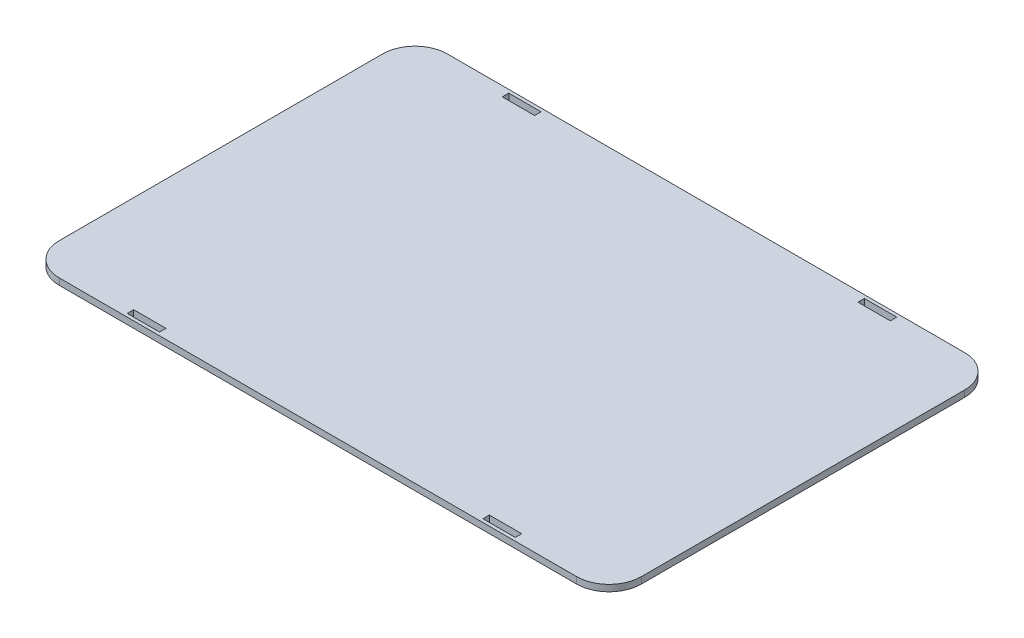
ISO-10303-21;
HEADER;
FILE_DESCRIPTION(('STEP AP214'),'2;1');
FILE_NAME('part.step','',(''),(''),'','','');
FILE_SCHEMA(('AUTOMOTIVE_DESIGN { 1 0 10303 214 1 1 1 1 }'));
ENDSEC;
DATA;
#1=APPLICATION_CONTEXT('core data for automotive mechanical design processes');
#2=APPLICATION_PROTOCOL_DEFINITION('international standard','automotive_design',2000,#1);
#3=PRODUCT_CONTEXT('',#1,'mechanical');
#4=PRODUCT('Part','Part','',(#3));
#5=PRODUCT_RELATED_PRODUCT_CATEGORY('part','',(#4));
#6=PRODUCT_DEFINITION_FORMATION('','',#4);
#7=PRODUCT_DEFINITION_CONTEXT('part definition',#1,'design');
#8=PRODUCT_DEFINITION('design','',#6,#7);
#9=PRODUCT_DEFINITION_SHAPE('','',#8);
#10=(LENGTH_UNIT() NAMED_UNIT(*) SI_UNIT(.MILLI.,.METRE.));
#11=(NAMED_UNIT(*) PLANE_ANGLE_UNIT() SI_UNIT($,.RADIAN.));
#12=(NAMED_UNIT(*) SI_UNIT($,.STERADIAN.) SOLID_ANGLE_UNIT());
#13=UNCERTAINTY_MEASURE_WITH_UNIT(LENGTH_MEASURE(1.E-05),#10,'distance_accuracy_value','');
#14=(GEOMETRIC_REPRESENTATION_CONTEXT(3) GLOBAL_UNCERTAINTY_ASSIGNED_CONTEXT((#13)) GLOBAL_UNIT_ASSIGNED_CONTEXT((#10,
#11,#12)) REPRESENTATION_CONTEXT('',''));
#15=CARTESIAN_POINT('',(0.,0.,0.));
#16=DIRECTION('',(0.,0.,1.));
#17=DIRECTION('',(1.,0.,0.));
#18=AXIS2_PLACEMENT_3D('',#15,#16,#17);
#19=CARTESIAN_POINT('',(0.,2.,0.));
#20=DIRECTION('',(0.,-1.,0.));
#21=DIRECTION('',(0.,0.,-1.));
#22=AXIS2_PLACEMENT_3D('',#19,#20,#21);
#23=PLANE('',#22);
#24=DIRECTION('',(0.,0.,1.));
#25=VECTOR('',#24,1.);
#26=CARTESIAN_POINT('',(-60.,2.,0.));
#27=LINE('',#26,#25);
#28=CARTESIAN_POINT('',(-60.,2.,57.));
#29=VERTEX_POINT('',#28);
#30=CARTESIAN_POINT('',(-60.,2.,59.));
#31=VERTEX_POINT('',#30);
#32=EDGE_CURVE('E312',#29,#31,#27,.T.);
#33=ORIENTED_EDGE('',*,*,#32,.F.);
#34=DIRECTION('',(-1.,0.,0.));
#35=VECTOR('',#34,1.);
#36=CARTESIAN_POINT('',(0.,2.,57.));
#37=LINE('',#36,#35);
#38=CARTESIAN_POINT('',(-50.,2.,57.));
#39=VERTEX_POINT('',#38);
#40=EDGE_CURVE('E306',#39,#29,#37,.T.);
#41=ORIENTED_EDGE('',*,*,#40,.F.);
#42=DIRECTION('',(0.,0.,-1.));
#43=VECTOR('',#42,1.);
#44=CARTESIAN_POINT('',(-50.,2.,0.));
#45=LINE('',#44,#43);
#46=CARTESIAN_POINT('',(-50.,2.,59.));
#47=VERTEX_POINT('',#46);
#48=EDGE_CURVE('E308',#47,#39,#45,.T.);
#49=ORIENTED_EDGE('',*,*,#48,.F.);
#50=DIRECTION('',(1.,0.,0.));
#51=VECTOR('',#50,1.);
#52=CARTESIAN_POINT('',(0.,2.,59.));
#53=LINE('',#52,#51);
#54=EDGE_CURVE('E310',#31,#47,#53,.T.);
#55=ORIENTED_EDGE('',*,*,#54,.F.);
#56=EDGE_LOOP('',(#33,#41,#49,#55));
#57=FACE_BOUND('',#56,.T.);
#58=DIRECTION('',(0.,0.,1.));
#59=VECTOR('',#58,1.);
#60=CARTESIAN_POINT('',(-60.,2.,0.));
#61=LINE('',#60,#59);
#62=CARTESIAN_POINT('',(-60.,2.,-59.));
#63=VERTEX_POINT('',#62);
#64=CARTESIAN_POINT('',(-60.,2.,-57.));
#65=VERTEX_POINT('',#64);
#66=EDGE_CURVE('E296',#63,#65,#61,.T.);
#67=ORIENTED_EDGE('',*,*,#66,.F.);
#68=DIRECTION('',(-1.,0.,0.));
#69=VECTOR('',#68,1.);
#70=CARTESIAN_POINT('',(0.,2.,-59.));
#71=LINE('',#70,#69);
#72=CARTESIAN_POINT('',(-50.,2.,-59.));
#73=VERTEX_POINT('',#72);
#74=EDGE_CURVE('E289',#73,#63,#71,.T.);
#75=ORIENTED_EDGE('',*,*,#74,.F.);
#76=DIRECTION('',(0.,0.,-1.));
#77=VECTOR('',#76,1.);
#78=CARTESIAN_POINT('',(-50.,2.,0.));
#79=LINE('',#78,#77);
#80=CARTESIAN_POINT('',(-50.,2.,-57.));
#81=VERTEX_POINT('',#80);
#82=EDGE_CURVE('E291',#81,#73,#79,.T.);
#83=ORIENTED_EDGE('',*,*,#82,.F.);
#84=DIRECTION('',(1.,0.,0.));
#85=VECTOR('',#84,1.);
#86=CARTESIAN_POINT('',(0.,2.,-57.));
#87=LINE('',#86,#85);
#88=EDGE_CURVE('E294',#65,#81,#87,.T.);
#89=ORIENTED_EDGE('',*,*,#88,.F.);
#90=EDGE_LOOP('',(#67,#75,#83,#89));
#91=FACE_BOUND('',#90,.T.);
#92=DIRECTION('',(0.,0.,-1.));
#93=VECTOR('',#92,1.);
#94=CARTESIAN_POINT('',(90.,2.,60.));
#95=LINE('',#94,#93);
#96=CARTESIAN_POINT('',(90.,2.,50.));
#97=VERTEX_POINT('',#96);
#98=CARTESIAN_POINT('',(90.,2.,-50.));
#99=VERTEX_POINT('',#98);
#100=EDGE_CURVE('E323',#97,#99,#95,.T.);
#101=ORIENTED_EDGE('',*,*,#100,.T.);
#102=CARTESIAN_POINT('',(80.,2.,-50.));
#103=DIRECTION('',(0.,-1.,0.));
#104=DIRECTION('',(0.,0.,-1.));
#105=AXIS2_PLACEMENT_3D('',#102,#103,#104);
#106=CIRCLE('',#105,10.);
#107=CARTESIAN_POINT('',(80.,2.,-60.));
#108=VERTEX_POINT('',#107);
#109=EDGE_CURVE('E41',#99,#108,#106,.F.);
#110=ORIENTED_EDGE('',*,*,#109,.T.);
#111=DIRECTION('',(-1.,0.,0.));
#112=VECTOR('',#111,1.);
#113=CARTESIAN_POINT('',(-90.,2.,-60.));
#114=LINE('',#113,#112);
#115=CARTESIAN_POINT('',(-80.,2.,-60.));
#116=VERTEX_POINT('',#115);
#117=EDGE_CURVE('E326',#108,#116,#114,.T.);
#118=ORIENTED_EDGE('',*,*,#117,.T.);
#119=CARTESIAN_POINT('',(-80.,2.,-50.));
#120=DIRECTION('',(0.,-1.,0.));
#121=DIRECTION('',(0.,0.,-1.));
#122=AXIS2_PLACEMENT_3D('',#119,#120,#121);
#123=CIRCLE('',#122,10.);
#124=CARTESIAN_POINT('',(-90.,2.,-50.));
#125=VERTEX_POINT('',#124);
#126=EDGE_CURVE('E359',#116,#125,#123,.F.);
#127=ORIENTED_EDGE('',*,*,#126,.T.);
#128=DIRECTION('',(0.,0.,1.));
#129=VECTOR('',#128,1.);
#130=CARTESIAN_POINT('',(-90.,2.,60.));
#131=LINE('',#130,#129);
#132=CARTESIAN_POINT('',(-90.,2.,50.));
#133=VERTEX_POINT('',#132);
#134=EDGE_CURVE('E329',#125,#133,#131,.T.);
#135=ORIENTED_EDGE('',*,*,#134,.T.);
#136=CARTESIAN_POINT('',(-80.,2.,50.));
#137=DIRECTION('',(0.,-1.,0.));
#138=DIRECTION('',(0.,0.,-1.));
#139=AXIS2_PLACEMENT_3D('',#136,#137,#138);
#140=CIRCLE('',#139,10.);
#141=CARTESIAN_POINT('',(-80.,2.,60.));
#142=VERTEX_POINT('',#141);
#143=EDGE_CURVE('E351',#133,#142,#140,.F.);
#144=ORIENTED_EDGE('',*,*,#143,.T.);
#145=DIRECTION('',(1.,0.,0.));
#146=VECTOR('',#145,1.);
#147=CARTESIAN_POINT('',(-90.,2.,60.));
#148=LINE('',#147,#146);
#149=CARTESIAN_POINT('',(80.,2.,60.));
#150=VERTEX_POINT('',#149);
#151=EDGE_CURVE('E331',#142,#150,#148,.T.);
#152=ORIENTED_EDGE('',*,*,#151,.T.);
#153=CARTESIAN_POINT('',(80.,2.,50.));
#154=DIRECTION('',(0.,-1.,0.));
#155=DIRECTION('',(0.,0.,-1.));
#156=AXIS2_PLACEMENT_3D('',#153,#154,#155);
#157=CIRCLE('',#156,10.);
#158=EDGE_CURVE('E370',#150,#97,#157,.F.);
#159=ORIENTED_EDGE('',*,*,#158,.T.);
#160=EDGE_LOOP('',(#101,#110,#118,#127,#135,#144,#152,#159));
#161=FACE_BOUND('',#160,.T.);
#162=DIRECTION('',(0.,0.,1.));
#163=VECTOR('',#162,1.);
#164=CARTESIAN_POINT('',(50.,2.,0.));
#165=LINE('',#164,#163);
#166=CARTESIAN_POINT('',(50.,2.,57.));
#167=VERTEX_POINT('',#166);
#168=CARTESIAN_POINT('',(50.,2.,59.));
#169=VERTEX_POINT('',#168);
#170=EDGE_CURVE('E200',#167,#169,#165,.T.);
#171=ORIENTED_EDGE('',*,*,#170,.F.);
#172=DIRECTION('',(-1.,0.,0.));
#173=VECTOR('',#172,1.);
#174=CARTESIAN_POINT('',(0.,2.,57.));
#175=LINE('',#174,#173);
#176=CARTESIAN_POINT('',(60.,2.,57.));
#177=VERTEX_POINT('',#176);
#178=EDGE_CURVE('E298',#177,#167,#175,.T.);
#179=ORIENTED_EDGE('',*,*,#178,.F.);
#180=DIRECTION('',(0.,0.,-1.));
#181=VECTOR('',#180,1.);
#182=CARTESIAN_POINT('',(60.,2.,0.));
#183=LINE('',#182,#181);
#184=CARTESIAN_POINT('',(60.,2.,59.));
#185=VERTEX_POINT('',#184);
#186=EDGE_CURVE('E300',#185,#177,#183,.T.);
#187=ORIENTED_EDGE('',*,*,#186,.F.);
#188=DIRECTION('',(1.,0.,0.));
#189=VECTOR('',#188,1.);
#190=CARTESIAN_POINT('',(0.,2.,59.));
#191=LINE('',#190,#189);
#192=EDGE_CURVE('E303',#169,#185,#191,.T.);
#193=ORIENTED_EDGE('',*,*,#192,.F.);
#194=EDGE_LOOP('',(#171,#179,#187,#193));
#195=FACE_BOUND('',#194,.T.);
#196=DIRECTION('',(0.,0.,1.));
#197=VECTOR('',#196,1.);
#198=CARTESIAN_POINT('',(50.,2.,0.));
#199=LINE('',#198,#197);
#200=CARTESIAN_POINT('',(50.,2.,-59.));
#201=VERTEX_POINT('',#200);
#202=CARTESIAN_POINT('',(50.,2.,-57.));
#203=VERTEX_POINT('',#202);
#204=EDGE_CURVE('E320',#201,#203,#199,.T.);
#205=ORIENTED_EDGE('',*,*,#204,.F.);
#206=DIRECTION('',(-1.,0.,0.));
#207=VECTOR('',#206,1.);
#208=CARTESIAN_POINT('',(0.,2.,-59.));
#209=LINE('',#208,#207);
#210=CARTESIAN_POINT('',(60.,2.,-59.));
#211=VERTEX_POINT('',#210);
#212=EDGE_CURVE('E314',#211,#201,#209,.T.);
#213=ORIENTED_EDGE('',*,*,#212,.F.);
#214=DIRECTION('',(0.,0.,-1.));
#215=VECTOR('',#214,1.);
#216=CARTESIAN_POINT('',(60.,2.,0.));
#217=LINE('',#216,#215);
#218=CARTESIAN_POINT('',(60.,2.,-57.));
#219=VERTEX_POINT('',#218);
#220=EDGE_CURVE('E316',#219,#211,#217,.T.);
#221=ORIENTED_EDGE('',*,*,#220,.F.);
#222=DIRECTION('',(1.,0.,0.));
#223=VECTOR('',#222,1.);
#224=CARTESIAN_POINT('',(0.,2.,-57.));
#225=LINE('',#224,#223);
#226=EDGE_CURVE('E318',#203,#219,#225,.T.);
#227=ORIENTED_EDGE('',*,*,#226,.F.);
#228=EDGE_LOOP('',(#205,#213,#221,#227));
#229=FACE_BOUND('',#228,.T.);
#230=ADVANCED_FACE('F33',(#57,#91,#161,#195,#229),#23,.F.);
#231=CARTESIAN_POINT('',(0.,0.,0.));
#232=DIRECTION('',(0.,-1.,0.));
#233=DIRECTION('',(0.,0.,-1.));
#234=AXIS2_PLACEMENT_3D('',#231,#232,#233);
#235=PLANE('',#234);
#236=DIRECTION('',(-1.,0.,0.));
#237=VECTOR('',#236,1.);
#238=CARTESIAN_POINT('',(-90.,0.,-60.));
#239=LINE('',#238,#237);
#240=CARTESIAN_POINT('',(80.,0.,-60.));
#241=VERTEX_POINT('',#240);
#242=CARTESIAN_POINT('',(-80.,0.,-60.));
#243=VERTEX_POINT('',#242);
#244=EDGE_CURVE('E337',#241,#243,#239,.T.);
#245=ORIENTED_EDGE('',*,*,#244,.F.);
#246=CARTESIAN_POINT('',(80.,0.,-50.));
#247=DIRECTION('',(0.,-1.,0.));
#248=DIRECTION('',(0.,0.,-1.));
#249=AXIS2_PLACEMENT_3D('',#246,#247,#248);
#250=CIRCLE('',#249,10.);
#251=CARTESIAN_POINT('',(90.,0.,-50.));
#252=VERTEX_POINT('',#251);
#253=EDGE_CURVE('E11',#241,#252,#250,.T.);
#254=ORIENTED_EDGE('',*,*,#253,.T.);
#255=DIRECTION('',(0.,0.,-1.));
#256=VECTOR('',#255,1.);
#257=CARTESIAN_POINT('',(90.,0.,60.));
#258=LINE('',#257,#256);
#259=CARTESIAN_POINT('',(90.,0.,50.));
#260=VERTEX_POINT('',#259);
#261=EDGE_CURVE('E322',#260,#252,#258,.T.);
#262=ORIENTED_EDGE('',*,*,#261,.F.);
#263=CARTESIAN_POINT('',(80.,0.,50.));
#264=DIRECTION('',(0.,-1.,0.));
#265=DIRECTION('',(0.,0.,-1.));
#266=AXIS2_PLACEMENT_3D('',#263,#264,#265);
#267=CIRCLE('',#266,10.);
#268=CARTESIAN_POINT('',(80.,0.,60.));
#269=VERTEX_POINT('',#268);
#270=EDGE_CURVE('E372',#260,#269,#267,.T.);
#271=ORIENTED_EDGE('',*,*,#270,.T.);
#272=DIRECTION('',(1.,0.,0.));
#273=VECTOR('',#272,1.);
#274=CARTESIAN_POINT('',(-90.,0.,60.));
#275=LINE('',#274,#273);
#276=CARTESIAN_POINT('',(-80.,0.,60.));
#277=VERTEX_POINT('',#276);
#278=EDGE_CURVE('E327',#277,#269,#275,.T.);
#279=ORIENTED_EDGE('',*,*,#278,.F.);
#280=CARTESIAN_POINT('',(-80.,0.,50.));
#281=DIRECTION('',(0.,-1.,0.));
#282=DIRECTION('',(0.,0.,-1.));
#283=AXIS2_PLACEMENT_3D('',#280,#281,#282);
#284=CIRCLE('',#283,10.);
#285=CARTESIAN_POINT('',(-90.,0.,50.));
#286=VERTEX_POINT('',#285);
#287=EDGE_CURVE('E348',#277,#286,#284,.T.);
#288=ORIENTED_EDGE('',*,*,#287,.T.);
#289=DIRECTION('',(0.,0.,1.));
#290=VECTOR('',#289,1.);
#291=CARTESIAN_POINT('',(-90.,0.,60.));
#292=LINE('',#291,#290);
#293=CARTESIAN_POINT('',(-90.,0.,-50.));
#294=VERTEX_POINT('',#293);
#295=EDGE_CURVE('E339',#294,#286,#292,.T.);
#296=ORIENTED_EDGE('',*,*,#295,.F.);
#297=CARTESIAN_POINT('',(-80.,0.,-50.));
#298=DIRECTION('',(0.,-1.,0.));
#299=DIRECTION('',(0.,0.,-1.));
#300=AXIS2_PLACEMENT_3D('',#297,#298,#299);
#301=CIRCLE('',#300,10.);
#302=EDGE_CURVE('E361',#294,#243,#301,.T.);
#303=ORIENTED_EDGE('',*,*,#302,.T.);
#304=EDGE_LOOP('',(#245,#254,#262,#271,#279,#288,#296,#303));
#305=FACE_BOUND('',#304,.T.);
#306=DIRECTION('',(-1.,0.,0.));
#307=VECTOR('',#306,1.);
#308=CARTESIAN_POINT('',(-60.,0.,-59.));
#309=LINE('',#308,#307);
#310=CARTESIAN_POINT('',(-50.,0.,-59.));
#311=VERTEX_POINT('',#310);
#312=CARTESIAN_POINT('',(-60.,0.,-59.));
#313=VERTEX_POINT('',#312);
#314=EDGE_CURVE('E277',#311,#313,#309,.T.);
#315=ORIENTED_EDGE('',*,*,#314,.T.);
#316=DIRECTION('',(0.,0.,1.));
#317=VECTOR('',#316,1.);
#318=CARTESIAN_POINT('',(-60.,0.,-59.));
#319=LINE('',#318,#317);
#320=CARTESIAN_POINT('',(-60.,0.,-57.));
#321=VERTEX_POINT('',#320);
#322=EDGE_CURVE('E250',#313,#321,#319,.T.);
#323=ORIENTED_EDGE('',*,*,#322,.T.);
#324=DIRECTION('',(1.,0.,0.));
#325=VECTOR('',#324,1.);
#326=CARTESIAN_POINT('',(-60.,0.,-57.));
#327=LINE('',#326,#325);
#328=CARTESIAN_POINT('',(-50.,0.,-57.));
#329=VERTEX_POINT('',#328);
#330=EDGE_CURVE('E271',#321,#329,#327,.T.);
#331=ORIENTED_EDGE('',*,*,#330,.T.);
#332=DIRECTION('',(0.,0.,-1.));
#333=VECTOR('',#332,1.);
#334=CARTESIAN_POINT('',(-50.,0.,-59.));
#335=LINE('',#334,#333);
#336=EDGE_CURVE('E274',#329,#311,#335,.T.);
#337=ORIENTED_EDGE('',*,*,#336,.T.);
#338=EDGE_LOOP('',(#315,#323,#331,#337));
#339=FACE_BOUND('',#338,.T.);
#340=DIRECTION('',(-1.,0.,0.));
#341=VECTOR('',#340,1.);
#342=CARTESIAN_POINT('',(50.,0.,57.));
#343=LINE('',#342,#341);
#344=CARTESIAN_POINT('',(60.,0.,57.));
#345=VERTEX_POINT('',#344);
#346=CARTESIAN_POINT('',(50.,0.,57.));
#347=VERTEX_POINT('',#346);
#348=EDGE_CURVE('E219',#345,#347,#343,.T.);
#349=ORIENTED_EDGE('',*,*,#348,.T.);
#350=DIRECTION('',(0.,0.,1.));
#351=VECTOR('',#350,1.);
#352=CARTESIAN_POINT('',(50.,0.,57.));
#353=LINE('',#352,#351);
#354=CARTESIAN_POINT('',(50.,0.,59.));
#355=VERTEX_POINT('',#354);
#356=EDGE_CURVE('E197',#347,#355,#353,.T.);
#357=ORIENTED_EDGE('',*,*,#356,.T.);
#358=DIRECTION('',(1.,0.,0.));
#359=VECTOR('',#358,1.);
#360=CARTESIAN_POINT('',(50.,0.,59.));
#361=LINE('',#360,#359);
#362=CARTESIAN_POINT('',(60.,0.,59.));
#363=VERTEX_POINT('',#362);
#364=EDGE_CURVE('E207',#355,#363,#361,.T.);
#365=ORIENTED_EDGE('',*,*,#364,.T.);
#366=DIRECTION('',(0.,0.,-1.));
#367=VECTOR('',#366,1.);
#368=CARTESIAN_POINT('',(60.,0.,57.));
#369=LINE('',#368,#367);
#370=EDGE_CURVE('E213',#363,#345,#369,.T.);
#371=ORIENTED_EDGE('',*,*,#370,.T.);
#372=EDGE_LOOP('',(#349,#357,#365,#371));
#373=FACE_BOUND('',#372,.T.);
#374=DIRECTION('',(-1.,0.,0.));
#375=VECTOR('',#374,1.);
#376=CARTESIAN_POINT('',(-60.,0.,57.));
#377=LINE('',#376,#375);
#378=CARTESIAN_POINT('',(-50.,0.,57.));
#379=VERTEX_POINT('',#378);
#380=CARTESIAN_POINT('',(-60.,0.,57.));
#381=VERTEX_POINT('',#380);
#382=EDGE_CURVE('E259',#379,#381,#377,.T.);
#383=ORIENTED_EDGE('',*,*,#382,.T.);
#384=DIRECTION('',(0.,0.,1.));
#385=VECTOR('',#384,1.);
#386=CARTESIAN_POINT('',(-60.,0.,57.));
#387=LINE('',#386,#385);
#388=CARTESIAN_POINT('',(-60.,0.,59.));
#389=VERTEX_POINT('',#388);
#390=EDGE_CURVE('E203',#381,#389,#387,.T.);
#391=ORIENTED_EDGE('',*,*,#390,.T.);
#392=DIRECTION('',(1.,0.,0.));
#393=VECTOR('',#392,1.);
#394=CARTESIAN_POINT('',(-60.,0.,59.));
#395=LINE('',#394,#393);
#396=CARTESIAN_POINT('',(-50.,0.,59.));
#397=VERTEX_POINT('',#396);
#398=EDGE_CURVE('E253',#389,#397,#395,.T.);
#399=ORIENTED_EDGE('',*,*,#398,.T.);
#400=DIRECTION('',(0.,0.,-1.));
#401=VECTOR('',#400,1.);
#402=CARTESIAN_POINT('',(-50.,0.,57.));
#403=LINE('',#402,#401);
#404=EDGE_CURVE('E256',#397,#379,#403,.T.);
#405=ORIENTED_EDGE('',*,*,#404,.T.);
#406=EDGE_LOOP('',(#383,#391,#399,#405));
#407=FACE_BOUND('',#406,.T.);
#408=DIRECTION('',(-1.,0.,0.));
#409=VECTOR('',#408,1.);
#410=CARTESIAN_POINT('',(50.,0.,-59.));
#411=LINE('',#410,#409);
#412=CARTESIAN_POINT('',(60.,0.,-59.));
#413=VERTEX_POINT('',#412);
#414=CARTESIAN_POINT('',(50.,0.,-59.));
#415=VERTEX_POINT('',#414);
#416=EDGE_CURVE('E239',#413,#415,#411,.T.);
#417=ORIENTED_EDGE('',*,*,#416,.T.);
#418=DIRECTION('',(0.,0.,1.));
#419=VECTOR('',#418,1.);
#420=CARTESIAN_POINT('',(50.,0.,-59.));
#421=LINE('',#420,#419);
#422=CARTESIAN_POINT('',(50.,0.,-57.));
#423=VERTEX_POINT('',#422);
#424=EDGE_CURVE('E229',#415,#423,#421,.T.);
#425=ORIENTED_EDGE('',*,*,#424,.T.);
#426=DIRECTION('',(1.,0.,0.));
#427=VECTOR('',#426,1.);
#428=CARTESIAN_POINT('',(50.,0.,-57.));
#429=LINE('',#428,#427);
#430=CARTESIAN_POINT('',(60.,0.,-57.));
#431=VERTEX_POINT('',#430);
#432=EDGE_CURVE('E232',#423,#431,#429,.T.);
#433=ORIENTED_EDGE('',*,*,#432,.T.);
#434=DIRECTION('',(0.,0.,-1.));
#435=VECTOR('',#434,1.);
#436=CARTESIAN_POINT('',(60.,0.,-59.));
#437=LINE('',#436,#435);
#438=EDGE_CURVE('E236',#431,#413,#437,.T.);
#439=ORIENTED_EDGE('',*,*,#438,.T.);
#440=EDGE_LOOP('',(#417,#425,#433,#439));
#441=FACE_BOUND('',#440,.T.);
#442=ADVANCED_FACE('F216',(#305,#339,#373,#407,#441),#235,.T.);
#443=CARTESIAN_POINT('',(80.,2.,-50.));
#444=DIRECTION('',(0.,-1.,0.));
#445=DIRECTION('',(0.,0.,-1.));
#446=AXIS2_PLACEMENT_3D('',#443,#444,#445);
#447=CYLINDRICAL_SURFACE('',#446,10.);
#448=DIRECTION('',(0.,-1.,0.));
#449=VECTOR('',#448,1.);
#450=CARTESIAN_POINT('',(80.,2.,-60.));
#451=LINE('',#450,#449);
#452=EDGE_CURVE('E374',#108,#241,#451,.T.);
#453=ORIENTED_EDGE('',*,*,#452,.F.);
#454=ORIENTED_EDGE('',*,*,#109,.F.);
#455=DIRECTION('',(0.,-1.,0.));
#456=VECTOR('',#455,1.);
#457=CARTESIAN_POINT('',(90.,2.,-50.));
#458=LINE('',#457,#456);
#459=EDGE_CURVE('E377',#252,#99,#458,.F.);
#460=ORIENTED_EDGE('',*,*,#459,.F.);
#461=ORIENTED_EDGE('',*,*,#253,.F.);
#462=EDGE_LOOP('',(#453,#454,#460,#461));
#463=FACE_BOUND('',#462,.T.);
#464=ADVANCED_FACE('F35',(#463),#447,.T.);
#465=CARTESIAN_POINT('',(80.,2.,50.));
#466=DIRECTION('',(0.,-1.,0.));
#467=DIRECTION('',(0.,0.,-1.));
#468=AXIS2_PLACEMENT_3D('',#465,#466,#467);
#469=CYLINDRICAL_SURFACE('',#468,10.);
#470=DIRECTION('',(0.,-1.,0.));
#471=VECTOR('',#470,1.);
#472=CARTESIAN_POINT('',(90.,2.,50.));
#473=LINE('',#472,#471);
#474=EDGE_CURVE('E364',#97,#260,#473,.T.);
#475=ORIENTED_EDGE('',*,*,#474,.F.);
#476=ORIENTED_EDGE('',*,*,#158,.F.);
#477=DIRECTION('',(0.,-1.,0.));
#478=VECTOR('',#477,1.);
#479=CARTESIAN_POINT('',(80.,2.,60.));
#480=LINE('',#479,#478);
#481=EDGE_CURVE('E367',#269,#150,#480,.F.);
#482=ORIENTED_EDGE('',*,*,#481,.F.);
#483=ORIENTED_EDGE('',*,*,#270,.F.);
#484=EDGE_LOOP('',(#475,#476,#482,#483));
#485=FACE_BOUND('',#484,.T.);
#486=ADVANCED_FACE('F412',(#485),#469,.T.);
#487=CARTESIAN_POINT('',(-80.,2.,-50.));
#488=DIRECTION('',(0.,-1.,0.));
#489=DIRECTION('',(0.,0.,-1.));
#490=AXIS2_PLACEMENT_3D('',#487,#488,#489);
#491=CYLINDRICAL_SURFACE('',#490,10.);
#492=DIRECTION('',(0.,-1.,0.));
#493=VECTOR('',#492,1.);
#494=CARTESIAN_POINT('',(-90.,2.,-50.));
#495=LINE('',#494,#493);
#496=EDGE_CURVE('E353',#125,#294,#495,.T.);
#497=ORIENTED_EDGE('',*,*,#496,.F.);
#498=ORIENTED_EDGE('',*,*,#126,.F.);
#499=DIRECTION('',(0.,-1.,0.));
#500=VECTOR('',#499,1.);
#501=CARTESIAN_POINT('',(-80.,2.,-60.));
#502=LINE('',#501,#500);
#503=EDGE_CURVE('E356',#243,#116,#502,.F.);
#504=ORIENTED_EDGE('',*,*,#503,.F.);
#505=ORIENTED_EDGE('',*,*,#302,.F.);
#506=EDGE_LOOP('',(#497,#498,#504,#505));
#507=FACE_BOUND('',#506,.T.);
#508=ADVANCED_FACE('F393',(#507),#491,.T.);
#509=CARTESIAN_POINT('',(-80.,2.,50.));
#510=DIRECTION('',(0.,1.,0.));
#511=DIRECTION('',(0.,0.,1.));
#512=AXIS2_PLACEMENT_3D('',#509,#510,#511);
#513=CYLINDRICAL_SURFACE('',#512,10.);
#514=DIRECTION('',(0.,1.,0.));
#515=VECTOR('',#514,1.);
#516=CARTESIAN_POINT('',(-90.,2.,50.));
#517=LINE('',#516,#515);
#518=EDGE_CURVE('E334',#286,#133,#517,.T.);
#519=ORIENTED_EDGE('',*,*,#518,.F.);
#520=ORIENTED_EDGE('',*,*,#287,.F.);
#521=DIRECTION('',(0.,1.,0.));
#522=VECTOR('',#521,1.);
#523=CARTESIAN_POINT('',(-80.,2.,60.));
#524=LINE('',#523,#522);
#525=EDGE_CURVE('E345',#142,#277,#524,.F.);
#526=ORIENTED_EDGE('',*,*,#525,.F.);
#527=ORIENTED_EDGE('',*,*,#143,.F.);
#528=EDGE_LOOP('',(#519,#520,#526,#527));
#529=FACE_BOUND('',#528,.T.);
#530=ADVANCED_FACE('F400',(#529),#513,.T.);
#531=CARTESIAN_POINT('',(90.,2.,60.));
#532=DIRECTION('',(-1.,0.,0.));
#533=DIRECTION('',(0.,0.,1.));
#534=AXIS2_PLACEMENT_3D('',#531,#532,#533);
#535=PLANE('',#534);
#536=ORIENTED_EDGE('',*,*,#261,.T.);
#537=ORIENTED_EDGE('',*,*,#459,.T.);
#538=ORIENTED_EDGE('',*,*,#100,.F.);
#539=ORIENTED_EDGE('',*,*,#474,.T.);
#540=EDGE_LOOP('',(#536,#537,#538,#539));
#541=FACE_BOUND('',#540,.T.);
#542=ADVANCED_FACE('F415',(#541),#535,.F.);
#543=CARTESIAN_POINT('',(-90.,2.,-60.));
#544=DIRECTION('',(0.,0.,1.));
#545=DIRECTION('',(1.,0.,0.));
#546=AXIS2_PLACEMENT_3D('',#543,#544,#545);
#547=PLANE('',#546);
#548=ORIENTED_EDGE('',*,*,#117,.F.);
#549=ORIENTED_EDGE('',*,*,#452,.T.);
#550=ORIENTED_EDGE('',*,*,#244,.T.);
#551=ORIENTED_EDGE('',*,*,#503,.T.);
#552=EDGE_LOOP('',(#548,#549,#550,#551));
#553=FACE_BOUND('',#552,.T.);
#554=ADVANCED_FACE('F389',(#553),#547,.F.);
#555=CARTESIAN_POINT('',(-90.,2.,60.));
#556=DIRECTION('',(1.,0.,0.));
#557=DIRECTION('',(0.,0.,-1.));
#558=AXIS2_PLACEMENT_3D('',#555,#556,#557);
#559=PLANE('',#558);
#560=ORIENTED_EDGE('',*,*,#134,.F.);
#561=ORIENTED_EDGE('',*,*,#496,.T.);
#562=ORIENTED_EDGE('',*,*,#295,.T.);
#563=ORIENTED_EDGE('',*,*,#518,.T.);
#564=EDGE_LOOP('',(#560,#561,#562,#563));
#565=FACE_BOUND('',#564,.T.);
#566=ADVANCED_FACE('F402',(#565),#559,.F.);
#567=CARTESIAN_POINT('',(-90.,2.,60.));
#568=DIRECTION('',(0.,0.,-1.));
#569=DIRECTION('',(-1.,0.,0.));
#570=AXIS2_PLACEMENT_3D('',#567,#568,#569);
#571=PLANE('',#570);
#572=ORIENTED_EDGE('',*,*,#278,.T.);
#573=ORIENTED_EDGE('',*,*,#481,.T.);
#574=ORIENTED_EDGE('',*,*,#151,.F.);
#575=ORIENTED_EDGE('',*,*,#525,.T.);
#576=EDGE_LOOP('',(#572,#573,#574,#575));
#577=FACE_BOUND('',#576,.T.);
#578=ADVANCED_FACE('F408',(#577),#571,.F.);
#579=CARTESIAN_POINT('',(-60.,7.,-59.));
#580=DIRECTION('',(1.,0.,0.));
#581=DIRECTION('',(0.,0.,-1.));
#582=AXIS2_PLACEMENT_3D('',#579,#580,#581);
#583=PLANE('',#582);
#584=ORIENTED_EDGE('',*,*,#66,.T.);
#585=DIRECTION('',(0.,-1.,0.));
#586=VECTOR('',#585,1.);
#587=CARTESIAN_POINT('',(-60.,7.,-57.));
#588=LINE('',#587,#586);
#589=EDGE_CURVE('E287',#65,#321,#588,.T.);
#590=ORIENTED_EDGE('',*,*,#589,.T.);
#591=ORIENTED_EDGE('',*,*,#322,.F.);
#592=DIRECTION('',(0.,-1.,0.));
#593=VECTOR('',#592,1.);
#594=CARTESIAN_POINT('',(-60.,7.,-59.));
#595=LINE('',#594,#593);
#596=EDGE_CURVE('E280',#63,#313,#595,.T.);
#597=ORIENTED_EDGE('',*,*,#596,.F.);
#598=EDGE_LOOP('',(#584,#590,#591,#597));
#599=FACE_BOUND('',#598,.T.);
#600=ADVANCED_FACE('F434',(#599),#583,.T.);
#601=CARTESIAN_POINT('',(-60.,7.,-57.));
#602=DIRECTION('',(0.,0.,-1.));
#603=DIRECTION('',(-1.,0.,0.));
#604=AXIS2_PLACEMENT_3D('',#601,#602,#603);
#605=PLANE('',#604);
#606=ORIENTED_EDGE('',*,*,#88,.T.);
#607=DIRECTION('',(0.,-1.,0.));
#608=VECTOR('',#607,1.);
#609=CARTESIAN_POINT('',(-50.,7.,-57.));
#610=LINE('',#609,#608);
#611=EDGE_CURVE('E285',#81,#329,#610,.T.);
#612=ORIENTED_EDGE('',*,*,#611,.T.);
#613=ORIENTED_EDGE('',*,*,#330,.F.);
#614=ORIENTED_EDGE('',*,*,#589,.F.);
#615=EDGE_LOOP('',(#606,#612,#613,#614));
#616=FACE_BOUND('',#615,.T.);
#617=ADVANCED_FACE('F457',(#616),#605,.T.);
#618=CARTESIAN_POINT('',(-50.,7.,-59.));
#619=DIRECTION('',(-1.,0.,0.));
#620=DIRECTION('',(0.,0.,1.));
#621=AXIS2_PLACEMENT_3D('',#618,#619,#620);
#622=PLANE('',#621);
#623=ORIENTED_EDGE('',*,*,#82,.T.);
#624=DIRECTION('',(0.,-1.,0.));
#625=VECTOR('',#624,1.);
#626=CARTESIAN_POINT('',(-50.,7.,-59.));
#627=LINE('',#626,#625);
#628=EDGE_CURVE('E283',#73,#311,#627,.T.);
#629=ORIENTED_EDGE('',*,*,#628,.T.);
#630=ORIENTED_EDGE('',*,*,#336,.F.);
#631=ORIENTED_EDGE('',*,*,#611,.F.);
#632=EDGE_LOOP('',(#623,#629,#630,#631));
#633=FACE_BOUND('',#632,.T.);
#634=ADVANCED_FACE('F465',(#633),#622,.T.);
#635=CARTESIAN_POINT('',(-60.,7.,-59.));
#636=DIRECTION('',(0.,0.,1.));
#637=DIRECTION('',(1.,0.,0.));
#638=AXIS2_PLACEMENT_3D('',#635,#636,#637);
#639=PLANE('',#638);
#640=ORIENTED_EDGE('',*,*,#74,.T.);
#641=ORIENTED_EDGE('',*,*,#596,.T.);
#642=ORIENTED_EDGE('',*,*,#314,.F.);
#643=ORIENTED_EDGE('',*,*,#628,.F.);
#644=EDGE_LOOP('',(#640,#641,#642,#643));
#645=FACE_BOUND('',#644,.T.);
#646=ADVANCED_FACE('F472',(#645),#639,.T.);
#647=CARTESIAN_POINT('',(50.,7.,57.));
#648=DIRECTION('',(1.,0.,0.));
#649=DIRECTION('',(0.,0.,-1.));
#650=AXIS2_PLACEMENT_3D('',#647,#648,#649);
#651=PLANE('',#650);
#652=ORIENTED_EDGE('',*,*,#170,.T.);
#653=DIRECTION('',(0.,-1.,0.));
#654=VECTOR('',#653,1.);
#655=CARTESIAN_POINT('',(50.,7.,59.));
#656=LINE('',#655,#654);
#657=EDGE_CURVE('E192',#169,#355,#656,.T.);
#658=ORIENTED_EDGE('',*,*,#657,.T.);
#659=ORIENTED_EDGE('',*,*,#356,.F.);
#660=DIRECTION('',(0.,-1.,0.));
#661=VECTOR('',#660,1.);
#662=CARTESIAN_POINT('',(50.,7.,57.));
#663=LINE('',#662,#661);
#664=EDGE_CURVE('E224',#167,#347,#663,.T.);
#665=ORIENTED_EDGE('',*,*,#664,.F.);
#666=EDGE_LOOP('',(#652,#658,#659,#665));
#667=FACE_BOUND('',#666,.T.);
#668=ADVANCED_FACE('F194',(#667),#651,.T.);
#669=CARTESIAN_POINT('',(50.,7.,59.));
#670=DIRECTION('',(0.,0.,-1.));
#671=DIRECTION('',(-1.,0.,0.));
#672=AXIS2_PLACEMENT_3D('',#669,#670,#671);
#673=PLANE('',#672);
#674=ORIENTED_EDGE('',*,*,#192,.T.);
#675=DIRECTION('',(0.,-1.,0.));
#676=VECTOR('',#675,1.);
#677=CARTESIAN_POINT('',(60.,7.,59.));
#678=LINE('',#677,#676);
#679=EDGE_CURVE('E204',#185,#363,#678,.T.);
#680=ORIENTED_EDGE('',*,*,#679,.T.);
#681=ORIENTED_EDGE('',*,*,#364,.F.);
#682=ORIENTED_EDGE('',*,*,#657,.F.);
#683=EDGE_LOOP('',(#674,#680,#681,#682));
#684=FACE_BOUND('',#683,.T.);
#685=ADVANCED_FACE('F208',(#684),#673,.T.);
#686=CARTESIAN_POINT('',(60.,7.,57.));
#687=DIRECTION('',(-1.,0.,0.));
#688=DIRECTION('',(0.,0.,1.));
#689=AXIS2_PLACEMENT_3D('',#686,#687,#688);
#690=PLANE('',#689);
#691=ORIENTED_EDGE('',*,*,#186,.T.);
#692=DIRECTION('',(0.,-1.,0.));
#693=VECTOR('',#692,1.);
#694=CARTESIAN_POINT('',(60.,7.,57.));
#695=LINE('',#694,#693);
#696=EDGE_CURVE('E226',#177,#345,#695,.T.);
#697=ORIENTED_EDGE('',*,*,#696,.T.);
#698=ORIENTED_EDGE('',*,*,#370,.F.);
#699=ORIENTED_EDGE('',*,*,#679,.F.);
#700=EDGE_LOOP('',(#691,#697,#698,#699));
#701=FACE_BOUND('',#700,.T.);
#702=ADVANCED_FACE('F493',(#701),#690,.T.);
#703=CARTESIAN_POINT('',(50.,7.,57.));
#704=DIRECTION('',(0.,0.,1.));
#705=DIRECTION('',(1.,0.,0.));
#706=AXIS2_PLACEMENT_3D('',#703,#704,#705);
#707=PLANE('',#706);
#708=ORIENTED_EDGE('',*,*,#178,.T.);
#709=ORIENTED_EDGE('',*,*,#664,.T.);
#710=ORIENTED_EDGE('',*,*,#348,.F.);
#711=ORIENTED_EDGE('',*,*,#696,.F.);
#712=EDGE_LOOP('',(#708,#709,#710,#711));
#713=FACE_BOUND('',#712,.T.);
#714=ADVANCED_FACE('F500',(#713),#707,.T.);
#715=CARTESIAN_POINT('',(-60.,7.,57.));
#716=DIRECTION('',(1.,0.,0.));
#717=DIRECTION('',(0.,0.,-1.));
#718=AXIS2_PLACEMENT_3D('',#715,#716,#717);
#719=PLANE('',#718);
#720=ORIENTED_EDGE('',*,*,#32,.T.);
#721=DIRECTION('',(0.,-1.,0.));
#722=VECTOR('',#721,1.);
#723=CARTESIAN_POINT('',(-60.,7.,59.));
#724=LINE('',#723,#722);
#725=EDGE_CURVE('E233',#31,#389,#724,.T.);
#726=ORIENTED_EDGE('',*,*,#725,.T.);
#727=ORIENTED_EDGE('',*,*,#390,.F.);
#728=DIRECTION('',(0.,-1.,0.));
#729=VECTOR('',#728,1.);
#730=CARTESIAN_POINT('',(-60.,7.,57.));
#731=LINE('',#730,#729);
#732=EDGE_CURVE('E262',#29,#381,#731,.T.);
#733=ORIENTED_EDGE('',*,*,#732,.F.);
#734=EDGE_LOOP('',(#720,#726,#727,#733));
#735=FACE_BOUND('',#734,.T.);
#736=ADVANCED_FACE('F508',(#735),#719,.T.);
#737=CARTESIAN_POINT('',(-60.,7.,59.));
#738=DIRECTION('',(0.,0.,-1.));
#739=DIRECTION('',(-1.,0.,0.));
#740=AXIS2_PLACEMENT_3D('',#737,#738,#739);
#741=PLANE('',#740);
#742=ORIENTED_EDGE('',*,*,#54,.T.);
#743=DIRECTION('',(0.,-1.,0.));
#744=VECTOR('',#743,1.);
#745=CARTESIAN_POINT('',(-50.,7.,59.));
#746=LINE('',#745,#744);
#747=EDGE_CURVE('E266',#47,#397,#746,.T.);
#748=ORIENTED_EDGE('',*,*,#747,.T.);
#749=ORIENTED_EDGE('',*,*,#398,.F.);
#750=ORIENTED_EDGE('',*,*,#725,.F.);
#751=EDGE_LOOP('',(#742,#748,#749,#750));
#752=FACE_BOUND('',#751,.T.);
#753=ADVANCED_FACE('F516',(#752),#741,.T.);
#754=CARTESIAN_POINT('',(-50.,7.,57.));
#755=DIRECTION('',(-1.,0.,0.));
#756=DIRECTION('',(0.,0.,1.));
#757=AXIS2_PLACEMENT_3D('',#754,#755,#756);
#758=PLANE('',#757);
#759=ORIENTED_EDGE('',*,*,#48,.T.);
#760=DIRECTION('',(0.,-1.,0.));
#761=VECTOR('',#760,1.);
#762=CARTESIAN_POINT('',(-50.,7.,57.));
#763=LINE('',#762,#761);
#764=EDGE_CURVE('E56',#39,#379,#763,.T.);
#765=ORIENTED_EDGE('',*,*,#764,.T.);
#766=ORIENTED_EDGE('',*,*,#404,.F.);
#767=ORIENTED_EDGE('',*,*,#747,.F.);
#768=EDGE_LOOP('',(#759,#765,#766,#767));
#769=FACE_BOUND('',#768,.T.);
#770=ADVANCED_FACE('F524',(#769),#758,.T.);
#771=CARTESIAN_POINT('',(-60.,7.,57.));
#772=DIRECTION('',(0.,0.,1.));
#773=DIRECTION('',(1.,0.,0.));
#774=AXIS2_PLACEMENT_3D('',#771,#772,#773);
#775=PLANE('',#774);
#776=ORIENTED_EDGE('',*,*,#40,.T.);
#777=ORIENTED_EDGE('',*,*,#732,.T.);
#778=ORIENTED_EDGE('',*,*,#382,.F.);
#779=ORIENTED_EDGE('',*,*,#764,.F.);
#780=EDGE_LOOP('',(#776,#777,#778,#779));
#781=FACE_BOUND('',#780,.T.);
#782=ADVANCED_FACE('F532',(#781),#775,.T.);
#783=CARTESIAN_POINT('',(50.,7.,-59.));
#784=DIRECTION('',(1.,0.,0.));
#785=DIRECTION('',(0.,0.,-1.));
#786=AXIS2_PLACEMENT_3D('',#783,#784,#785);
#787=PLANE('',#786);
#788=ORIENTED_EDGE('',*,*,#204,.T.);
#789=DIRECTION('',(0.,-1.,0.));
#790=VECTOR('',#789,1.);
#791=CARTESIAN_POINT('',(50.,7.,-57.));
#792=LINE('',#791,#790);
#793=EDGE_CURVE('E248',#203,#423,#792,.T.);
#794=ORIENTED_EDGE('',*,*,#793,.T.);
#795=ORIENTED_EDGE('',*,*,#424,.F.);
#796=DIRECTION('',(0.,-1.,0.));
#797=VECTOR('',#796,1.);
#798=CARTESIAN_POINT('',(50.,7.,-59.));
#799=LINE('',#798,#797);
#800=EDGE_CURVE('E242',#201,#415,#799,.T.);
#801=ORIENTED_EDGE('',*,*,#800,.F.);
#802=EDGE_LOOP('',(#788,#794,#795,#801));
#803=FACE_BOUND('',#802,.T.);
#804=ADVANCED_FACE('F540',(#803),#787,.T.);
#805=CARTESIAN_POINT('',(50.,7.,-57.));
#806=DIRECTION('',(0.,0.,-1.));
#807=DIRECTION('',(-1.,0.,0.));
#808=AXIS2_PLACEMENT_3D('',#805,#806,#807);
#809=PLANE('',#808);
#810=ORIENTED_EDGE('',*,*,#226,.T.);
#811=DIRECTION('',(0.,-1.,0.));
#812=VECTOR('',#811,1.);
#813=CARTESIAN_POINT('',(60.,7.,-57.));
#814=LINE('',#813,#812);
#815=EDGE_CURVE('E246',#219,#431,#814,.T.);
#816=ORIENTED_EDGE('',*,*,#815,.T.);
#817=ORIENTED_EDGE('',*,*,#432,.F.);
#818=ORIENTED_EDGE('',*,*,#793,.F.);
#819=EDGE_LOOP('',(#810,#816,#817,#818));
#820=FACE_BOUND('',#819,.T.);
#821=ADVANCED_FACE('F547',(#820),#809,.T.);
#822=CARTESIAN_POINT('',(60.,7.,-59.));
#823=DIRECTION('',(-1.,0.,0.));
#824=DIRECTION('',(0.,0.,1.));
#825=AXIS2_PLACEMENT_3D('',#822,#823,#824);
#826=PLANE('',#825);
#827=ORIENTED_EDGE('',*,*,#220,.T.);
#828=DIRECTION('',(0.,-1.,0.));
#829=VECTOR('',#828,1.);
#830=CARTESIAN_POINT('',(60.,7.,-59.));
#831=LINE('',#830,#829);
#832=EDGE_CURVE('E48',#211,#413,#831,.T.);
#833=ORIENTED_EDGE('',*,*,#832,.T.);
#834=ORIENTED_EDGE('',*,*,#438,.F.);
#835=ORIENTED_EDGE('',*,*,#815,.F.);
#836=EDGE_LOOP('',(#827,#833,#834,#835));
#837=FACE_BOUND('',#836,.T.);
#838=ADVANCED_FACE('F555',(#837),#826,.T.);
#839=CARTESIAN_POINT('',(50.,7.,-59.));
#840=DIRECTION('',(0.,0.,1.));
#841=DIRECTION('',(1.,0.,0.));
#842=AXIS2_PLACEMENT_3D('',#839,#840,#841);
#843=PLANE('',#842);
#844=ORIENTED_EDGE('',*,*,#212,.T.);
#845=ORIENTED_EDGE('',*,*,#800,.T.);
#846=ORIENTED_EDGE('',*,*,#416,.F.);
#847=ORIENTED_EDGE('',*,*,#832,.F.);
#848=EDGE_LOOP('',(#844,#845,#846,#847));
#849=FACE_BOUND('',#848,.T.);
#850=ADVANCED_FACE('F563',(#849),#843,.T.);
#851=CLOSED_SHELL('',(#230,#442,#464,#486,#508,#530,#542,#554,#566,#578,#600,#617,#634,#646,
#668,#685,#702,#714,#736,#753,#770,#782,#804,#821,#838,#850));
#852=MANIFOLD_SOLID_BREP('B2',#851);
#853=ADVANCED_BREP_SHAPE_REPRESENTATION('',(#18,#852),#14);
#854=SHAPE_DEFINITION_REPRESENTATION(#9,#853);
ENDSEC;
END-ISO-10303-21;
